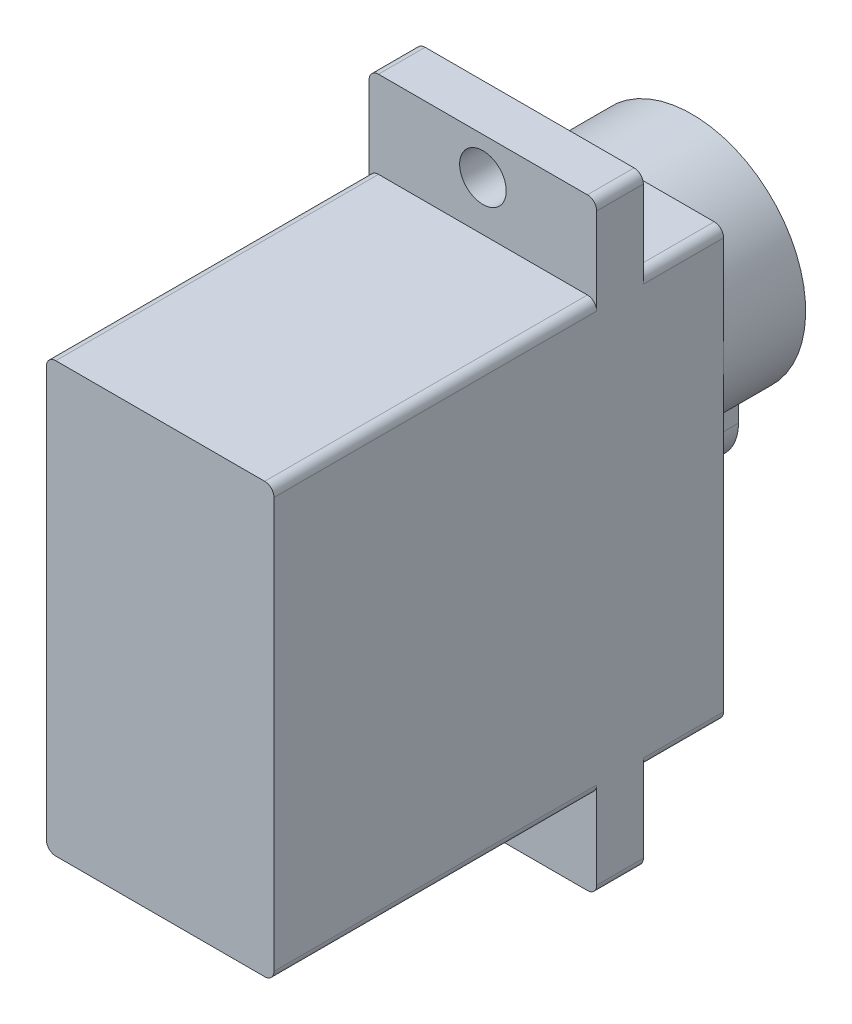
ISO-10303-21;
HEADER;
FILE_DESCRIPTION(('STEP AP214'),'2;1');
FILE_NAME('part.step','',(''),(''),'','','');
FILE_SCHEMA(('AUTOMOTIVE_DESIGN { 1 0 10303 214 1 1 1 1 }'));
ENDSEC;
DATA;
#1=APPLICATION_CONTEXT('core data for automotive mechanical design processes');
#2=APPLICATION_PROTOCOL_DEFINITION('international standard','automotive_design',2000,#1);
#3=PRODUCT_CONTEXT('',#1,'mechanical');
#4=PRODUCT('Part','Part','',(#3));
#5=PRODUCT_RELATED_PRODUCT_CATEGORY('part','',(#4));
#6=PRODUCT_DEFINITION_FORMATION('','',#4);
#7=PRODUCT_DEFINITION_CONTEXT('part definition',#1,'design');
#8=PRODUCT_DEFINITION('design','',#6,#7);
#9=PRODUCT_DEFINITION_SHAPE('','',#8);
#10=(LENGTH_UNIT() NAMED_UNIT(*) SI_UNIT(.MILLI.,.METRE.));
#11=(NAMED_UNIT(*) PLANE_ANGLE_UNIT() SI_UNIT($,.RADIAN.));
#12=(NAMED_UNIT(*) SI_UNIT($,.STERADIAN.) SOLID_ANGLE_UNIT());
#13=UNCERTAINTY_MEASURE_WITH_UNIT(LENGTH_MEASURE(1.E-05),#10,'distance_accuracy_value','');
#14=(GEOMETRIC_REPRESENTATION_CONTEXT(3) GLOBAL_UNCERTAINTY_ASSIGNED_CONTEXT((#13)) GLOBAL_UNIT_ASSIGNED_CONTEXT((#10,
#11,#12)) REPRESENTATION_CONTEXT('',''));
#15=CARTESIAN_POINT('',(0.,0.,0.));
#16=DIRECTION('',(0.,0.,1.));
#17=DIRECTION('',(1.,0.,0.));
#18=AXIS2_PLACEMENT_3D('',#15,#16,#17);
#19=CARTESIAN_POINT('',(5.6,-11.,-12.05));
#20=DIRECTION('',(0.,0.,1.));
#21=DIRECTION('',(1.,0.,0.));
#22=AXIS2_PLACEMENT_3D('',#19,#20,#21);
#23=PLANE('',#22);
#24=CARTESIAN_POINT('',(0.,5.4,-12.05));
#25=DIRECTION('',(0.,0.,-1.));
#26=DIRECTION('',(-1.,0.,0.));
#27=AXIS2_PLACEMENT_3D('',#24,#25,#26);
#28=CIRCLE('',#27,6.1);
#29=CARTESIAN_POINT('',(0.,11.5,-12.05));
#30=VERTEX_POINT('',#29);
#31=CARTESIAN_POINT('',(6.1,5.4,-12.05));
#32=VERTEX_POINT('',#31);
#33=EDGE_CURVE('E443',#30,#32,#28,.T.);
#34=ORIENTED_EDGE('',*,*,#33,.F.);
#35=DIRECTION('',(-1.,0.,0.));
#36=VECTOR('',#35,1.);
#37=CARTESIAN_POINT('',(-5.6,11.5,-12.05));
#38=LINE('',#37,#36);
#39=CARTESIAN_POINT('',(5.59999999999999,11.5,-12.05));
#40=VERTEX_POINT('',#39);
#41=EDGE_CURVE('E396',#40,#30,#38,.T.);
#42=ORIENTED_EDGE('',*,*,#41,.F.);
#43=CARTESIAN_POINT('',(5.6,11.,-12.05));
#44=DIRECTION('',(0.,0.,1.));
#45=DIRECTION('',(-1.,0.,0.));
#46=AXIS2_PLACEMENT_3D('',#43,#44,#45);
#47=CIRCLE('',#46,0.5);
#48=CARTESIAN_POINT('',(6.1,11.,-12.05));
#49=VERTEX_POINT('',#48);
#50=EDGE_CURVE('E392',#49,#40,#47,.T.);
#51=ORIENTED_EDGE('',*,*,#50,.F.);
#52=DIRECTION('',(0.,1.,0.));
#53=VECTOR('',#52,1.);
#54=CARTESIAN_POINT('',(6.1,-11.,-12.05));
#55=LINE('',#54,#53);
#56=EDGE_CURVE('E388',#32,#49,#55,.T.);
#57=ORIENTED_EDGE('',*,*,#56,.F.);
#58=EDGE_LOOP('',(#34,#42,#51,#57));
#59=FACE_BOUND('',#58,.T.);
#60=ADVANCED_FACE('F37',(#59),#23,.F.);
#61=CARTESIAN_POINT('',(2.5,-0.164171097297423,-12.05));
#62=VERTEX_POINT('',#61);
#63=EDGE_CURVE('E447',#32,#62,#28,.T.);
#64=ORIENTED_EDGE('',*,*,#63,.F.);
#65=CARTESIAN_POINT('',(6.1,-11.,-12.05));
#66=VERTEX_POINT('',#65);
#67=EDGE_CURVE('E389',#66,#32,#55,.T.);
#68=ORIENTED_EDGE('',*,*,#67,.F.);
#69=CARTESIAN_POINT('',(5.6,-11.,-12.05));
#70=DIRECTION('',(0.,0.,1.));
#71=DIRECTION('',(1.,0.,0.));
#72=AXIS2_PLACEMENT_3D('',#69,#70,#71);
#73=CIRCLE('',#72,0.5);
#74=CARTESIAN_POINT('',(5.59999999999999,-11.5,-12.05));
#75=VERTEX_POINT('',#74);
#76=EDGE_CURVE('E366',#75,#66,#73,.T.);
#77=ORIENTED_EDGE('',*,*,#76,.F.);
#78=DIRECTION('',(1.,0.,0.));
#79=VECTOR('',#78,1.);
#80=CARTESIAN_POINT('',(-5.6,-11.5,-12.05));
#81=LINE('',#80,#79);
#82=CARTESIAN_POINT('',(-5.6,-11.5,-12.05));
#83=VERTEX_POINT('',#82);
#84=EDGE_CURVE('E371',#83,#75,#81,.T.);
#85=ORIENTED_EDGE('',*,*,#84,.F.);
#86=CARTESIAN_POINT('',(-5.6,-11.,-12.05));
#87=DIRECTION('',(0.,0.,1.));
#88=DIRECTION('',(-1.,0.,0.));
#89=AXIS2_PLACEMENT_3D('',#86,#87,#88);
#90=CIRCLE('',#89,0.5);
#91=CARTESIAN_POINT('',(-6.1,-11.,-12.05));
#92=VERTEX_POINT('',#91);
#93=EDGE_CURVE('E406',#92,#83,#90,.T.);
#94=ORIENTED_EDGE('',*,*,#93,.F.);
#95=DIRECTION('',(0.,-1.,0.));
#96=VECTOR('',#95,1.);
#97=CARTESIAN_POINT('',(-6.1,-11.,-12.05));
#98=LINE('',#97,#96);
#99=CARTESIAN_POINT('',(-6.1,5.4,-12.05));
#100=VERTEX_POINT('',#99);
#101=EDGE_CURVE('E402',#100,#92,#98,.T.);
#102=ORIENTED_EDGE('',*,*,#101,.F.);
#103=CARTESIAN_POINT('',(-2.5,-0.164171097297423,-12.05));
#104=VERTEX_POINT('',#103);
#105=EDGE_CURVE('E449',#104,#100,#28,.T.);
#106=ORIENTED_EDGE('',*,*,#105,.F.);
#107=DIRECTION('',(0.,1.,0.));
#108=VECTOR('',#107,1.);
#109=CARTESIAN_POINT('',(-2.5,-1.6,-12.05));
#110=LINE('',#109,#108);
#111=CARTESIAN_POINT('',(-2.5,-1.6,-12.05));
#112=VERTEX_POINT('',#111);
#113=EDGE_CURVE('E455',#112,#104,#110,.T.);
#114=ORIENTED_EDGE('',*,*,#113,.F.);
#115=CARTESIAN_POINT('',(0.,-1.6,-12.05));
#116=DIRECTION('',(0.,0.,-1.));
#117=DIRECTION('',(-1.,0.,0.));
#118=AXIS2_PLACEMENT_3D('',#115,#116,#117);
#119=CIRCLE('',#118,2.5);
#120=CARTESIAN_POINT('',(2.5,-1.6,-12.05));
#121=VERTEX_POINT('',#120);
#122=EDGE_CURVE('E58',#121,#112,#119,.T.);
#123=ORIENTED_EDGE('',*,*,#122,.F.);
#124=DIRECTION('',(0.,-1.,0.));
#125=VECTOR('',#124,1.);
#126=CARTESIAN_POINT('',(2.5,-1.6,-12.05));
#127=LINE('',#126,#125);
#128=EDGE_CURVE('E53',#62,#121,#127,.T.);
#129=ORIENTED_EDGE('',*,*,#128,.F.);
#130=EDGE_LOOP('',(#64,#68,#77,#85,#94,#102,#106,#114,#123,#129));
#131=FACE_BOUND('',#130,.T.);
#132=ADVANCED_FACE('F464',(#131),#23,.F.);
#133=EDGE_CURVE('E441',#100,#30,#28,.T.);
#134=ORIENTED_EDGE('',*,*,#133,.F.);
#135=CARTESIAN_POINT('',(-6.1,11.,-12.05));
#136=VERTEX_POINT('',#135);
#137=EDGE_CURVE('E403',#136,#100,#98,.T.);
#138=ORIENTED_EDGE('',*,*,#137,.F.);
#139=CARTESIAN_POINT('',(-5.6,11.,-12.05));
#140=DIRECTION('',(0.,0.,1.));
#141=DIRECTION('',(-1.,0.,0.));
#142=AXIS2_PLACEMENT_3D('',#139,#140,#141);
#143=CIRCLE('',#142,0.5);
#144=CARTESIAN_POINT('',(-5.6,11.5,-12.05));
#145=VERTEX_POINT('',#144);
#146=EDGE_CURVE('E399',#145,#136,#143,.T.);
#147=ORIENTED_EDGE('',*,*,#146,.F.);
#148=EDGE_CURVE('E395',#30,#145,#38,.T.);
#149=ORIENTED_EDGE('',*,*,#148,.F.);
#150=EDGE_LOOP('',(#134,#138,#147,#149));
#151=FACE_BOUND('',#150,.T.);
#152=ADVANCED_FACE('F461',(#151),#23,.F.);
#153=CARTESIAN_POINT('',(5.6,-11.,12.05));
#154=DIRECTION('',(0.,0.,-1.));
#155=DIRECTION('',(-1.,0.,0.));
#156=AXIS2_PLACEMENT_3D('',#153,#154,#155);
#157=CYLINDRICAL_SURFACE('',#156,0.5);
#158=CARTESIAN_POINT('',(5.6,-11.,-5.25));
#159=DIRECTION('',(0.,0.,-1.));
#160=DIRECTION('',(-1.,0.,0.));
#161=AXIS2_PLACEMENT_3D('',#158,#159,#160);
#162=CIRCLE('',#161,0.5);
#163=CARTESIAN_POINT('',(6.1,-11.,-5.25));
#164=VERTEX_POINT('',#163);
#165=CARTESIAN_POINT('',(5.59999999999999,-11.5,-5.25));
#166=VERTEX_POINT('',#165);
#167=EDGE_CURVE('E278',#164,#166,#162,.T.);
#168=ORIENTED_EDGE('',*,*,#167,.F.);
#169=DIRECTION('',(0.,0.,-1.));
#170=VECTOR('',#169,1.);
#171=CARTESIAN_POINT('',(6.1,-11.,12.05));
#172=LINE('',#171,#170);
#173=CARTESIAN_POINT('',(6.1,-11.,12.05));
#174=VERTEX_POINT('',#173);
#175=EDGE_CURVE('E439',#174,#164,#172,.T.);
#176=ORIENTED_EDGE('',*,*,#175,.F.);
#177=CARTESIAN_POINT('',(5.6,-11.,12.05));
#178=DIRECTION('',(0.,0.,1.));
#179=DIRECTION('',(1.,0.,0.));
#180=AXIS2_PLACEMENT_3D('',#177,#178,#179);
#181=CIRCLE('',#180,0.5);
#182=CARTESIAN_POINT('',(5.59999999999999,-11.5,12.05));
#183=VERTEX_POINT('',#182);
#184=EDGE_CURVE('E367',#183,#174,#181,.T.);
#185=ORIENTED_EDGE('',*,*,#184,.F.);
#186=DIRECTION('',(0.,0.,-1.));
#187=VECTOR('',#186,1.);
#188=CARTESIAN_POINT('',(5.59999999999999,-11.5,12.05));
#189=LINE('',#188,#187);
#190=EDGE_CURVE('E411',#183,#166,#189,.T.);
#191=ORIENTED_EDGE('',*,*,#190,.T.);
#192=EDGE_LOOP('',(#168,#176,#185,#191));
#193=FACE_BOUND('',#192,.T.);
#194=ADVANCED_FACE('F575',(#193),#157,.T.);
#195=CARTESIAN_POINT('',(-5.6,-11.,12.05));
#196=DIRECTION('',(0.,0.,-1.));
#197=DIRECTION('',(-1.,0.,0.));
#198=AXIS2_PLACEMENT_3D('',#195,#196,#197);
#199=CYLINDRICAL_SURFACE('',#198,0.5);
#200=CARTESIAN_POINT('',(-5.6,-11.,-5.25));
#201=DIRECTION('',(0.,0.,-1.));
#202=DIRECTION('',(-1.,0.,0.));
#203=AXIS2_PLACEMENT_3D('',#200,#201,#202);
#204=CIRCLE('',#203,0.5);
#205=CARTESIAN_POINT('',(-5.6,-11.5,-5.25));
#206=VERTEX_POINT('',#205);
#207=CARTESIAN_POINT('',(-6.1,-11.,-5.25));
#208=VERTEX_POINT('',#207);
#209=EDGE_CURVE('E264',#206,#208,#204,.T.);
#210=ORIENTED_EDGE('',*,*,#209,.F.);
#211=DIRECTION('',(0.,0.,-1.));
#212=VECTOR('',#211,1.);
#213=CARTESIAN_POINT('',(-5.6,-11.5,12.05));
#214=LINE('',#213,#212);
#215=CARTESIAN_POINT('',(-5.6,-11.5,12.05));
#216=VERTEX_POINT('',#215);
#217=EDGE_CURVE('E415',#216,#206,#214,.T.);
#218=ORIENTED_EDGE('',*,*,#217,.F.);
#219=CARTESIAN_POINT('',(-5.6,-11.,12.05));
#220=DIRECTION('',(0.,0.,1.));
#221=DIRECTION('',(-1.,0.,0.));
#222=AXIS2_PLACEMENT_3D('',#219,#220,#221);
#223=CIRCLE('',#222,0.5);
#224=CARTESIAN_POINT('',(-6.1,-11.,12.05));
#225=VERTEX_POINT('',#224);
#226=EDGE_CURVE('E381',#225,#216,#223,.T.);
#227=ORIENTED_EDGE('',*,*,#226,.F.);
#228=DIRECTION('',(0.,0.,-1.));
#229=VECTOR('',#228,1.);
#230=CARTESIAN_POINT('',(-6.1,-11.,12.05));
#231=LINE('',#230,#229);
#232=EDGE_CURVE('E419',#225,#208,#231,.T.);
#233=ORIENTED_EDGE('',*,*,#232,.T.);
#234=EDGE_LOOP('',(#210,#218,#227,#233));
#235=FACE_BOUND('',#234,.T.);
#236=ADVANCED_FACE('F530',(#235),#199,.T.);
#237=CARTESIAN_POINT('',(-5.6,-11.5,12.05));
#238=DIRECTION('',(0.,1.,0.));
#239=DIRECTION('',(0.,0.,1.));
#240=AXIS2_PLACEMENT_3D('',#237,#238,#239);
#241=PLANE('',#240);
#242=DIRECTION('',(-1.,0.,0.));
#243=VECTOR('',#242,1.);
#244=CARTESIAN_POINT('',(5.59999999999999,-11.5,-5.25));
#245=LINE('',#244,#243);
#246=EDGE_CURVE('E280',#166,#206,#245,.T.);
#247=ORIENTED_EDGE('',*,*,#246,.F.);
#248=ORIENTED_EDGE('',*,*,#190,.F.);
#249=DIRECTION('',(1.,0.,0.));
#250=VECTOR('',#249,1.);
#251=CARTESIAN_POINT('',(-5.6,-11.5,12.05));
#252=LINE('',#251,#250);
#253=EDGE_CURVE('E383',#216,#183,#252,.T.);
#254=ORIENTED_EDGE('',*,*,#253,.F.);
#255=ORIENTED_EDGE('',*,*,#217,.T.);
#256=EDGE_LOOP('',(#247,#248,#254,#255));
#257=FACE_BOUND('',#256,.T.);
#258=ADVANCED_FACE('F578',(#257),#241,.F.);
#259=CARTESIAN_POINT('',(5.6,11.,12.05));
#260=DIRECTION('',(0.,0.,-1.));
#261=DIRECTION('',(-1.,0.,0.));
#262=AXIS2_PLACEMENT_3D('',#259,#260,#261);
#263=CYLINDRICAL_SURFACE('',#262,0.5);
#264=CARTESIAN_POINT('',(5.6,11.,-7.75));
#265=DIRECTION('',(0.,0.,-1.));
#266=DIRECTION('',(1.,0.,0.));
#267=AXIS2_PLACEMENT_3D('',#264,#265,#266);
#268=CIRCLE('',#267,0.5);
#269=CARTESIAN_POINT('',(5.59999999999999,11.5,-7.75));
#270=VERTEX_POINT('',#269);
#271=CARTESIAN_POINT('',(6.1,11.,-7.75));
#272=VERTEX_POINT('',#271);
#273=EDGE_CURVE('E315',#270,#272,#268,.T.);
#274=ORIENTED_EDGE('',*,*,#273,.T.);
#275=DIRECTION('',(0.,0.,-1.));
#276=VECTOR('',#275,1.);
#277=CARTESIAN_POINT('',(6.1,11.,12.05));
#278=LINE('',#277,#276);
#279=EDGE_CURVE('E434',#272,#49,#278,.T.);
#280=ORIENTED_EDGE('',*,*,#279,.T.);
#281=ORIENTED_EDGE('',*,*,#50,.T.);
#282=DIRECTION('',(0.,0.,-1.));
#283=VECTOR('',#282,1.);
#284=CARTESIAN_POINT('',(5.59999999999999,11.5,12.05));
#285=LINE('',#284,#283);
#286=EDGE_CURVE('E430',#270,#40,#285,.T.);
#287=ORIENTED_EDGE('',*,*,#286,.F.);
#288=EDGE_LOOP('',(#274,#280,#281,#287));
#289=FACE_BOUND('',#288,.T.);
#290=ADVANCED_FACE('F560',(#289),#263,.T.);
#291=CARTESIAN_POINT('',(-5.6,11.5,12.05));
#292=DIRECTION('',(0.,-1.,0.));
#293=DIRECTION('',(0.,0.,-1.));
#294=AXIS2_PLACEMENT_3D('',#291,#292,#293);
#295=PLANE('',#294);
#296=DIRECTION('',(1.,0.,0.));
#297=VECTOR('',#296,1.);
#298=CARTESIAN_POINT('',(5.59999999999999,11.5,-7.75));
#299=LINE('',#298,#297);
#300=CARTESIAN_POINT('',(-5.6,11.5,-7.75));
#301=VERTEX_POINT('',#300);
#302=EDGE_CURVE('E322',#301,#270,#299,.T.);
#303=ORIENTED_EDGE('',*,*,#302,.T.);
#304=ORIENTED_EDGE('',*,*,#286,.T.);
#305=ORIENTED_EDGE('',*,*,#41,.T.);
#306=ORIENTED_EDGE('',*,*,#148,.T.);
#307=DIRECTION('',(0.,0.,-1.));
#308=VECTOR('',#307,1.);
#309=CARTESIAN_POINT('',(-5.6,11.5,12.05));
#310=LINE('',#309,#308);
#311=EDGE_CURVE('E426',#301,#145,#310,.T.);
#312=ORIENTED_EDGE('',*,*,#311,.F.);
#313=EDGE_LOOP('',(#303,#304,#305,#306,#312));
#314=FACE_BOUND('',#313,.T.);
#315=ADVANCED_FACE('F477',(#314),#295,.F.);
#316=CARTESIAN_POINT('',(-5.6,11.,12.05));
#317=DIRECTION('',(0.,0.,-1.));
#318=DIRECTION('',(-1.,0.,0.));
#319=AXIS2_PLACEMENT_3D('',#316,#317,#318);
#320=CYLINDRICAL_SURFACE('',#319,0.5);
#321=CARTESIAN_POINT('',(-5.6,11.,-7.75));
#322=DIRECTION('',(0.,0.,-1.));
#323=DIRECTION('',(1.,0.,0.));
#324=AXIS2_PLACEMENT_3D('',#321,#322,#323);
#325=CIRCLE('',#324,0.5);
#326=CARTESIAN_POINT('',(-6.1,11.,-7.75));
#327=VERTEX_POINT('',#326);
#328=EDGE_CURVE('E350',#327,#301,#325,.T.);
#329=ORIENTED_EDGE('',*,*,#328,.T.);
#330=ORIENTED_EDGE('',*,*,#311,.T.);
#331=ORIENTED_EDGE('',*,*,#146,.T.);
#332=DIRECTION('',(0.,0.,-1.));
#333=VECTOR('',#332,1.);
#334=CARTESIAN_POINT('',(-6.1,11.,12.05));
#335=LINE('',#334,#333);
#336=EDGE_CURVE('E422',#327,#136,#335,.T.);
#337=ORIENTED_EDGE('',*,*,#336,.F.);
#338=EDGE_LOOP('',(#329,#330,#331,#337));
#339=FACE_BOUND('',#338,.T.);
#340=ADVANCED_FACE('F474',(#339),#320,.T.);
#341=CARTESIAN_POINT('',(6.1,-11.,-7.75));
#342=VERTEX_POINT('',#341);
#343=EDGE_CURVE('E438',#342,#66,#172,.T.);
#344=ORIENTED_EDGE('',*,*,#343,.F.);
#345=CARTESIAN_POINT('',(5.6,-11.,-7.75));
#346=DIRECTION('',(0.,0.,-1.));
#347=DIRECTION('',(-1.,0.,0.));
#348=AXIS2_PLACEMENT_3D('',#345,#346,#347);
#349=CIRCLE('',#348,0.5);
#350=CARTESIAN_POINT('',(5.59999999999999,-11.5,-7.75));
#351=VERTEX_POINT('',#350);
#352=EDGE_CURVE('E295',#342,#351,#349,.T.);
#353=ORIENTED_EDGE('',*,*,#352,.T.);
#354=EDGE_CURVE('E385',#351,#75,#189,.T.);
#355=ORIENTED_EDGE('',*,*,#354,.T.);
#356=ORIENTED_EDGE('',*,*,#76,.T.);
#357=EDGE_LOOP('',(#344,#353,#355,#356));
#358=FACE_BOUND('',#357,.T.);
#359=ADVANCED_FACE('F491',(#358),#157,.T.);
#360=CARTESIAN_POINT('',(6.1,-11.,12.05));
#361=DIRECTION('',(-1.,0.,0.));
#362=DIRECTION('',(0.,0.,1.));
#363=AXIS2_PLACEMENT_3D('',#360,#361,#362);
#364=PLANE('',#363);
#365=ORIENTED_EDGE('',*,*,#67,.T.);
#366=ORIENTED_EDGE('',*,*,#56,.T.);
#367=ORIENTED_EDGE('',*,*,#279,.F.);
#368=DIRECTION('',(0.,1.,0.));
#369=VECTOR('',#368,1.);
#370=CARTESIAN_POINT('',(6.1,11.,-7.75));
#371=LINE('',#370,#369);
#372=CARTESIAN_POINT('',(6.1,15.65,-7.75));
#373=VERTEX_POINT('',#372);
#374=EDGE_CURVE('E339',#272,#373,#371,.T.);
#375=ORIENTED_EDGE('',*,*,#374,.T.);
#376=DIRECTION('',(0.,0.,-1.));
#377=VECTOR('',#376,1.);
#378=CARTESIAN_POINT('',(6.1,15.65,-5.25));
#379=LINE('',#378,#377);
#380=CARTESIAN_POINT('',(6.1,15.65,-5.25));
#381=VERTEX_POINT('',#380);
#382=EDGE_CURVE('E363',#381,#373,#379,.T.);
#383=ORIENTED_EDGE('',*,*,#382,.F.);
#384=DIRECTION('',(0.,1.,0.));
#385=VECTOR('',#384,1.);
#386=CARTESIAN_POINT('',(6.1,11.,-5.25));
#387=LINE('',#386,#385);
#388=CARTESIAN_POINT('',(6.1,11.,-5.25));
#389=VERTEX_POINT('',#388);
#390=EDGE_CURVE('E321',#389,#381,#387,.T.);
#391=ORIENTED_EDGE('',*,*,#390,.F.);
#392=CARTESIAN_POINT('',(6.1,11.,12.05));
#393=VERTEX_POINT('',#392);
#394=EDGE_CURVE('E435',#393,#389,#278,.T.);
#395=ORIENTED_EDGE('',*,*,#394,.F.);
#396=DIRECTION('',(0.,1.,0.));
#397=VECTOR('',#396,1.);
#398=CARTESIAN_POINT('',(6.1,-11.,12.05));
#399=LINE('',#398,#397);
#400=EDGE_CURVE('E370',#174,#393,#399,.T.);
#401=ORIENTED_EDGE('',*,*,#400,.F.);
#402=ORIENTED_EDGE('',*,*,#175,.T.);
#403=DIRECTION('',(0.,1.,0.));
#404=VECTOR('',#403,1.);
#405=CARTESIAN_POINT('',(6.1,-11.,-5.25));
#406=LINE('',#405,#404);
#407=CARTESIAN_POINT('',(6.1,-15.65,-5.25));
#408=VERTEX_POINT('',#407);
#409=EDGE_CURVE('E276',#408,#164,#406,.T.);
#410=ORIENTED_EDGE('',*,*,#409,.F.);
#411=DIRECTION('',(0.,0.,-1.));
#412=VECTOR('',#411,1.);
#413=CARTESIAN_POINT('',(6.1,-15.65,-5.25));
#414=LINE('',#413,#412);
#415=CARTESIAN_POINT('',(6.1,-15.65,-7.75));
#416=VERTEX_POINT('',#415);
#417=EDGE_CURVE('E282',#408,#416,#414,.T.);
#418=ORIENTED_EDGE('',*,*,#417,.T.);
#419=DIRECTION('',(0.,1.,0.));
#420=VECTOR('',#419,1.);
#421=CARTESIAN_POINT('',(6.1,-11.,-7.75));
#422=LINE('',#421,#420);
#423=EDGE_CURVE('E293',#416,#342,#422,.T.);
#424=ORIENTED_EDGE('',*,*,#423,.T.);
#425=ORIENTED_EDGE('',*,*,#343,.T.);
#426=EDGE_LOOP('',(#365,#366,#367,#375,#383,#391,#395,#401,#402,#410,#418,#424,#425));
#427=FACE_BOUND('',#426,.T.);
#428=ADVANCED_FACE('F487',(#427),#364,.F.);
#429=ORIENTED_EDGE('',*,*,#394,.T.);
#430=CARTESIAN_POINT('',(5.6,11.,-5.25));
#431=DIRECTION('',(0.,0.,-1.));
#432=DIRECTION('',(1.,0.,0.));
#433=AXIS2_PLACEMENT_3D('',#430,#431,#432);
#434=CIRCLE('',#433,0.5);
#435=CARTESIAN_POINT('',(5.59999999999999,11.5,-5.25));
#436=VERTEX_POINT('',#435);
#437=EDGE_CURVE('E318',#436,#389,#434,.T.);
#438=ORIENTED_EDGE('',*,*,#437,.F.);
#439=CARTESIAN_POINT('',(5.59999999999999,11.5,12.05));
#440=VERTEX_POINT('',#439);
#441=EDGE_CURVE('E431',#440,#436,#285,.T.);
#442=ORIENTED_EDGE('',*,*,#441,.F.);
#443=CARTESIAN_POINT('',(5.6,11.,12.05));
#444=DIRECTION('',(0.,0.,1.));
#445=DIRECTION('',(-1.,0.,0.));
#446=AXIS2_PLACEMENT_3D('',#443,#444,#445);
#447=CIRCLE('',#446,0.5);
#448=EDGE_CURVE('E373',#393,#440,#447,.T.);
#449=ORIENTED_EDGE('',*,*,#448,.F.);
#450=EDGE_LOOP('',(#429,#438,#442,#449));
#451=FACE_BOUND('',#450,.T.);
#452=ADVANCED_FACE('F571',(#451),#263,.T.);
#453=ORIENTED_EDGE('',*,*,#441,.T.);
#454=DIRECTION('',(1.,0.,0.));
#455=VECTOR('',#454,1.);
#456=CARTESIAN_POINT('',(5.59999999999999,11.5,-5.25));
#457=LINE('',#456,#455);
#458=CARTESIAN_POINT('',(-5.6,11.5,-5.25));
#459=VERTEX_POINT('',#458);
#460=EDGE_CURVE('E334',#459,#436,#457,.T.);
#461=ORIENTED_EDGE('',*,*,#460,.F.);
#462=CARTESIAN_POINT('',(-5.6,11.5,12.05));
#463=VERTEX_POINT('',#462);
#464=EDGE_CURVE('E427',#463,#459,#310,.T.);
#465=ORIENTED_EDGE('',*,*,#464,.F.);
#466=DIRECTION('',(-1.,0.,0.));
#467=VECTOR('',#466,1.);
#468=CARTESIAN_POINT('',(-5.6,11.5,12.05));
#469=LINE('',#468,#467);
#470=EDGE_CURVE('E375',#440,#463,#469,.T.);
#471=ORIENTED_EDGE('',*,*,#470,.F.);
#472=EDGE_LOOP('',(#453,#461,#465,#471));
#473=FACE_BOUND('',#472,.T.);
#474=ADVANCED_FACE('F611',(#473),#295,.F.);
#475=ORIENTED_EDGE('',*,*,#464,.T.);
#476=CARTESIAN_POINT('',(-5.6,11.,-5.25));
#477=DIRECTION('',(0.,0.,-1.));
#478=DIRECTION('',(1.,0.,0.));
#479=AXIS2_PLACEMENT_3D('',#476,#477,#478);
#480=CIRCLE('',#479,0.5);
#481=CARTESIAN_POINT('',(-6.1,11.,-5.25));
#482=VERTEX_POINT('',#481);
#483=EDGE_CURVE('E332',#482,#459,#480,.T.);
#484=ORIENTED_EDGE('',*,*,#483,.F.);
#485=CARTESIAN_POINT('',(-6.1,11.,12.05));
#486=VERTEX_POINT('',#485);
#487=EDGE_CURVE('E423',#486,#482,#335,.T.);
#488=ORIENTED_EDGE('',*,*,#487,.F.);
#489=CARTESIAN_POINT('',(-5.6,11.,12.05));
#490=DIRECTION('',(0.,0.,1.));
#491=DIRECTION('',(-1.,0.,0.));
#492=AXIS2_PLACEMENT_3D('',#489,#490,#491);
#493=CIRCLE('',#492,0.5);
#494=EDGE_CURVE('E377',#463,#486,#493,.T.);
#495=ORIENTED_EDGE('',*,*,#494,.F.);
#496=EDGE_LOOP('',(#475,#484,#488,#495));
#497=FACE_BOUND('',#496,.T.);
#498=ADVANCED_FACE('F541',(#497),#320,.T.);
#499=CARTESIAN_POINT('',(-6.1,-11.,12.05));
#500=DIRECTION('',(1.,0.,0.));
#501=DIRECTION('',(0.,0.,-1.));
#502=AXIS2_PLACEMENT_3D('',#499,#500,#501);
#503=PLANE('',#502);
#504=ORIENTED_EDGE('',*,*,#137,.T.);
#505=ORIENTED_EDGE('',*,*,#101,.T.);
#506=CARTESIAN_POINT('',(-6.1,-11.,-7.75));
#507=VERTEX_POINT('',#506);
#508=EDGE_CURVE('E418',#507,#92,#231,.T.);
#509=ORIENTED_EDGE('',*,*,#508,.F.);
#510=DIRECTION('',(0.,-1.,0.));
#511=VECTOR('',#510,1.);
#512=CARTESIAN_POINT('',(-6.1,-11.,-7.75));
#513=LINE('',#512,#511);
#514=CARTESIAN_POINT('',(-6.1,-15.65,-7.75));
#515=VERTEX_POINT('',#514);
#516=EDGE_CURVE('E285',#507,#515,#513,.T.);
#517=ORIENTED_EDGE('',*,*,#516,.T.);
#518=DIRECTION('',(0.,0.,-1.));
#519=VECTOR('',#518,1.);
#520=CARTESIAN_POINT('',(-6.1,-15.65,-5.25));
#521=LINE('',#520,#519);
#522=CARTESIAN_POINT('',(-6.1,-15.65,-5.25));
#523=VERTEX_POINT('',#522);
#524=EDGE_CURVE('E308',#523,#515,#521,.T.);
#525=ORIENTED_EDGE('',*,*,#524,.F.);
#526=DIRECTION('',(0.,-1.,0.));
#527=VECTOR('',#526,1.);
#528=CARTESIAN_POINT('',(-6.1,-11.,-5.25));
#529=LINE('',#528,#527);
#530=EDGE_CURVE('E267',#208,#523,#529,.T.);
#531=ORIENTED_EDGE('',*,*,#530,.F.);
#532=ORIENTED_EDGE('',*,*,#232,.F.);
#533=DIRECTION('',(0.,-1.,0.));
#534=VECTOR('',#533,1.);
#535=CARTESIAN_POINT('',(-6.1,-11.,12.05));
#536=LINE('',#535,#534);
#537=EDGE_CURVE('E379',#486,#225,#536,.T.);
#538=ORIENTED_EDGE('',*,*,#537,.F.);
#539=ORIENTED_EDGE('',*,*,#487,.T.);
#540=DIRECTION('',(0.,-1.,0.));
#541=VECTOR('',#540,1.);
#542=CARTESIAN_POINT('',(-6.1,11.,-5.25));
#543=LINE('',#542,#541);
#544=CARTESIAN_POINT('',(-6.1,15.65,-5.25));
#545=VERTEX_POINT('',#544);
#546=EDGE_CURVE('E330',#545,#482,#543,.T.);
#547=ORIENTED_EDGE('',*,*,#546,.F.);
#548=DIRECTION('',(0.,0.,-1.));
#549=VECTOR('',#548,1.);
#550=CARTESIAN_POINT('',(-6.1,15.65,-5.25));
#551=LINE('',#550,#549);
#552=CARTESIAN_POINT('',(-6.1,15.65,-7.75));
#553=VERTEX_POINT('',#552);
#554=EDGE_CURVE('E336',#545,#553,#551,.T.);
#555=ORIENTED_EDGE('',*,*,#554,.T.);
#556=DIRECTION('',(0.,-1.,0.));
#557=VECTOR('',#556,1.);
#558=CARTESIAN_POINT('',(-6.1,11.,-7.75));
#559=LINE('',#558,#557);
#560=EDGE_CURVE('E347',#553,#327,#559,.T.);
#561=ORIENTED_EDGE('',*,*,#560,.T.);
#562=ORIENTED_EDGE('',*,*,#336,.T.);
#563=EDGE_LOOP('',(#504,#505,#509,#517,#525,#531,#532,#538,#539,#547,#555,#561,#562));
#564=FACE_BOUND('',#563,.T.);
#565=ADVANCED_FACE('F469',(#564),#503,.F.);
#566=CARTESIAN_POINT('',(-5.6,-11.5,-7.75));
#567=VERTEX_POINT('',#566);
#568=EDGE_CURVE('E414',#567,#83,#214,.T.);
#569=ORIENTED_EDGE('',*,*,#568,.F.);
#570=CARTESIAN_POINT('',(-5.6,-11.,-7.75));
#571=DIRECTION('',(0.,0.,-1.));
#572=DIRECTION('',(-1.,0.,0.));
#573=AXIS2_PLACEMENT_3D('',#570,#571,#572);
#574=CIRCLE('',#573,0.5);
#575=EDGE_CURVE('E262',#567,#507,#574,.T.);
#576=ORIENTED_EDGE('',*,*,#575,.T.);
#577=ORIENTED_EDGE('',*,*,#508,.T.);
#578=ORIENTED_EDGE('',*,*,#93,.T.);
#579=EDGE_LOOP('',(#569,#576,#577,#578));
#580=FACE_BOUND('',#579,.T.);
#581=ADVANCED_FACE('F498',(#580),#199,.T.);
#582=ORIENTED_EDGE('',*,*,#354,.F.);
#583=DIRECTION('',(-1.,0.,0.));
#584=VECTOR('',#583,1.);
#585=CARTESIAN_POINT('',(5.59999999999999,-11.5,-7.75));
#586=LINE('',#585,#584);
#587=EDGE_CURVE('E268',#351,#567,#586,.T.);
#588=ORIENTED_EDGE('',*,*,#587,.T.);
#589=ORIENTED_EDGE('',*,*,#568,.T.);
#590=ORIENTED_EDGE('',*,*,#84,.T.);
#591=EDGE_LOOP('',(#582,#588,#589,#590));
#592=FACE_BOUND('',#591,.T.);
#593=ADVANCED_FACE('F495',(#592),#241,.F.);
#594=CARTESIAN_POINT('',(5.6,-11.,12.05));
#595=DIRECTION('',(0.,0.,1.));
#596=DIRECTION('',(1.,0.,0.));
#597=AXIS2_PLACEMENT_3D('',#594,#595,#596);
#598=PLANE('',#597);
#599=ORIENTED_EDGE('',*,*,#184,.T.);
#600=ORIENTED_EDGE('',*,*,#400,.T.);
#601=ORIENTED_EDGE('',*,*,#448,.T.);
#602=ORIENTED_EDGE('',*,*,#470,.T.);
#603=ORIENTED_EDGE('',*,*,#494,.T.);
#604=ORIENTED_EDGE('',*,*,#537,.T.);
#605=ORIENTED_EDGE('',*,*,#226,.T.);
#606=ORIENTED_EDGE('',*,*,#253,.T.);
#607=EDGE_LOOP('',(#599,#600,#601,#602,#603,#604,#605,#606));
#608=FACE_BOUND('',#607,.T.);
#609=ADVANCED_FACE('F533',(#608),#598,.T.);
#610=CARTESIAN_POINT('',(5.6,11.,-5.25));
#611=DIRECTION('',(0.,0.,1.));
#612=DIRECTION('',(1.,0.,0.));
#613=AXIS2_PLACEMENT_3D('',#610,#611,#612);
#614=PLANE('',#613);
#615=ORIENTED_EDGE('',*,*,#437,.T.);
#616=ORIENTED_EDGE('',*,*,#390,.T.);
#617=CARTESIAN_POINT('',(5.6,15.65,-5.25));
#618=DIRECTION('',(0.,0.,1.));
#619=DIRECTION('',(1.,0.,0.));
#620=AXIS2_PLACEMENT_3D('',#617,#618,#619);
#621=CIRCLE('',#620,0.5);
#622=CARTESIAN_POINT('',(5.59999999999999,16.15,-5.25));
#623=VERTEX_POINT('',#622);
#624=EDGE_CURVE('E324',#381,#623,#621,.T.);
#625=ORIENTED_EDGE('',*,*,#624,.T.);
#626=DIRECTION('',(-1.,0.,0.));
#627=VECTOR('',#626,1.);
#628=CARTESIAN_POINT('',(-5.6,16.15,-5.25));
#629=LINE('',#628,#627);
#630=CARTESIAN_POINT('',(-5.6,16.15,-5.25));
#631=VERTEX_POINT('',#630);
#632=EDGE_CURVE('E326',#623,#631,#629,.T.);
#633=ORIENTED_EDGE('',*,*,#632,.T.);
#634=CARTESIAN_POINT('',(-5.6,15.65,-5.25));
#635=DIRECTION('',(0.,0.,1.));
#636=DIRECTION('',(-1.,0.,0.));
#637=AXIS2_PLACEMENT_3D('',#634,#635,#636);
#638=CIRCLE('',#637,0.5);
#639=EDGE_CURVE('E328',#631,#545,#638,.T.);
#640=ORIENTED_EDGE('',*,*,#639,.T.);
#641=ORIENTED_EDGE('',*,*,#546,.T.);
#642=ORIENTED_EDGE('',*,*,#483,.T.);
#643=ORIENTED_EDGE('',*,*,#460,.T.);
#644=EDGE_LOOP('',(#615,#616,#625,#633,#640,#641,#642,#643));
#645=FACE_BOUND('',#644,.T.);
#646=CARTESIAN_POINT('',(0.,14.15,-5.25));
#647=DIRECTION('',(0.,0.,1.));
#648=DIRECTION('',(1.,0.,0.));
#649=AXIS2_PLACEMENT_3D('',#646,#647,#648);
#650=CIRCLE('',#649,1.25);
#651=CARTESIAN_POINT('',(1.25,14.15,-5.25));
#652=VERTEX_POINT('',#651);
#653=EDGE_CURVE('E312',#652,#652,#650,.T.);
#654=ORIENTED_EDGE('',*,*,#653,.F.);
#655=EDGE_LOOP('',(#654));
#656=FACE_BOUND('',#655,.T.);
#657=ADVANCED_FACE('F545',(#645,#656),#614,.T.);
#658=CARTESIAN_POINT('',(5.6,11.,-7.75));
#659=DIRECTION('',(0.,0.,1.));
#660=DIRECTION('',(1.,0.,0.));
#661=AXIS2_PLACEMENT_3D('',#658,#659,#660);
#662=PLANE('',#661);
#663=ORIENTED_EDGE('',*,*,#273,.F.);
#664=ORIENTED_EDGE('',*,*,#302,.F.);
#665=ORIENTED_EDGE('',*,*,#328,.F.);
#666=ORIENTED_EDGE('',*,*,#560,.F.);
#667=CARTESIAN_POINT('',(-5.6,15.65,-7.75));
#668=DIRECTION('',(0.,0.,1.));
#669=DIRECTION('',(-1.,0.,0.));
#670=AXIS2_PLACEMENT_3D('',#667,#668,#669);
#671=CIRCLE('',#670,0.5);
#672=CARTESIAN_POINT('',(-5.6,16.15,-7.75));
#673=VERTEX_POINT('',#672);
#674=EDGE_CURVE('E345',#673,#553,#671,.T.);
#675=ORIENTED_EDGE('',*,*,#674,.F.);
#676=DIRECTION('',(-1.,0.,0.));
#677=VECTOR('',#676,1.);
#678=CARTESIAN_POINT('',(-5.6,16.15,-7.75));
#679=LINE('',#678,#677);
#680=CARTESIAN_POINT('',(5.59999999999999,16.15,-7.75));
#681=VERTEX_POINT('',#680);
#682=EDGE_CURVE('E343',#681,#673,#679,.T.);
#683=ORIENTED_EDGE('',*,*,#682,.F.);
#684=CARTESIAN_POINT('',(5.6,15.65,-7.75));
#685=DIRECTION('',(0.,0.,1.));
#686=DIRECTION('',(1.,0.,0.));
#687=AXIS2_PLACEMENT_3D('',#684,#685,#686);
#688=CIRCLE('',#687,0.5);
#689=EDGE_CURVE('E341',#373,#681,#688,.T.);
#690=ORIENTED_EDGE('',*,*,#689,.F.);
#691=ORIENTED_EDGE('',*,*,#374,.F.);
#692=EDGE_LOOP('',(#663,#664,#665,#666,#675,#683,#690,#691));
#693=FACE_BOUND('',#692,.T.);
#694=CARTESIAN_POINT('',(0.,14.15,-7.75));
#695=DIRECTION('',(0.,0.,1.));
#696=DIRECTION('',(1.,0.,0.));
#697=AXIS2_PLACEMENT_3D('',#694,#695,#696);
#698=CIRCLE('',#697,1.25);
#699=CARTESIAN_POINT('',(1.25,14.15,-7.75));
#700=VERTEX_POINT('',#699);
#701=EDGE_CURVE('E311',#700,#700,#698,.T.);
#702=ORIENTED_EDGE('',*,*,#701,.T.);
#703=EDGE_LOOP('',(#702));
#704=FACE_BOUND('',#703,.T.);
#705=ADVANCED_FACE('F556',(#693,#704),#662,.F.);
#706=CARTESIAN_POINT('',(5.6,15.65,-5.25));
#707=DIRECTION('',(0.,0.,-1.));
#708=DIRECTION('',(-1.,0.,0.));
#709=AXIS2_PLACEMENT_3D('',#706,#707,#708);
#710=CYLINDRICAL_SURFACE('',#709,0.5);
#711=ORIENTED_EDGE('',*,*,#689,.T.);
#712=DIRECTION('',(0.,0.,-1.));
#713=VECTOR('',#712,1.);
#714=CARTESIAN_POINT('',(5.59999999999999,16.15,-5.25));
#715=LINE('',#714,#713);
#716=EDGE_CURVE('E360',#623,#681,#715,.T.);
#717=ORIENTED_EDGE('',*,*,#716,.F.);
#718=ORIENTED_EDGE('',*,*,#624,.F.);
#719=ORIENTED_EDGE('',*,*,#382,.T.);
#720=EDGE_LOOP('',(#711,#717,#718,#719));
#721=FACE_BOUND('',#720,.T.);
#722=ADVANCED_FACE('F564',(#721),#710,.T.);
#723=CARTESIAN_POINT('',(-5.6,16.15,-5.25));
#724=DIRECTION('',(0.,-1.,0.));
#725=DIRECTION('',(0.,0.,-1.));
#726=AXIS2_PLACEMENT_3D('',#723,#724,#725);
#727=PLANE('',#726);
#728=ORIENTED_EDGE('',*,*,#682,.T.);
#729=DIRECTION('',(0.,0.,-1.));
#730=VECTOR('',#729,1.);
#731=CARTESIAN_POINT('',(-5.6,16.15,-5.25));
#732=LINE('',#731,#730);
#733=EDGE_CURVE('E357',#631,#673,#732,.T.);
#734=ORIENTED_EDGE('',*,*,#733,.F.);
#735=ORIENTED_EDGE('',*,*,#632,.F.);
#736=ORIENTED_EDGE('',*,*,#716,.T.);
#737=EDGE_LOOP('',(#728,#734,#735,#736));
#738=FACE_BOUND('',#737,.T.);
#739=ADVANCED_FACE('F761',(#738),#727,.F.);
#740=CARTESIAN_POINT('',(-5.6,15.65,-5.25));
#741=DIRECTION('',(0.,0.,-1.));
#742=DIRECTION('',(-1.,0.,0.));
#743=AXIS2_PLACEMENT_3D('',#740,#741,#742);
#744=CYLINDRICAL_SURFACE('',#743,0.5);
#745=ORIENTED_EDGE('',*,*,#674,.T.);
#746=ORIENTED_EDGE('',*,*,#554,.F.);
#747=ORIENTED_EDGE('',*,*,#639,.F.);
#748=ORIENTED_EDGE('',*,*,#733,.T.);
#749=EDGE_LOOP('',(#745,#746,#747,#748));
#750=FACE_BOUND('',#749,.T.);
#751=ADVANCED_FACE('F552',(#750),#744,.T.);
#752=CARTESIAN_POINT('',(0.,14.15,-5.25));
#753=DIRECTION('',(0.,0.,-1.));
#754=DIRECTION('',(-1.,0.,0.));
#755=AXIS2_PLACEMENT_3D('',#752,#753,#754);
#756=CYLINDRICAL_SURFACE('',#755,1.25);
#757=ORIENTED_EDGE('',*,*,#653,.T.);
#758=EDGE_LOOP('',(#757));
#759=FACE_BOUND('',#758,.T.);
#760=ORIENTED_EDGE('',*,*,#701,.F.);
#761=EDGE_LOOP('',(#760));
#762=FACE_BOUND('',#761,.T.);
#763=ADVANCED_FACE('F743',(#759,#762),#756,.F.);
#764=CARTESIAN_POINT('',(-5.6,-11.,-5.25));
#765=DIRECTION('',(0.,0.,-1.));
#766=DIRECTION('',(-1.,0.,0.));
#767=AXIS2_PLACEMENT_3D('',#764,#765,#766);
#768=PLANE('',#767);
#769=ORIENTED_EDGE('',*,*,#209,.T.);
#770=ORIENTED_EDGE('',*,*,#530,.T.);
#771=CARTESIAN_POINT('',(-5.6,-15.65,-5.25));
#772=DIRECTION('',(0.,0.,1.));
#773=DIRECTION('',(-1.,0.,0.));
#774=AXIS2_PLACEMENT_3D('',#771,#772,#773);
#775=CIRCLE('',#774,0.5);
#776=CARTESIAN_POINT('',(-5.59999999999999,-16.15,-5.25));
#777=VERTEX_POINT('',#776);
#778=EDGE_CURVE('E270',#523,#777,#775,.T.);
#779=ORIENTED_EDGE('',*,*,#778,.T.);
#780=DIRECTION('',(1.,0.,0.));
#781=VECTOR('',#780,1.);
#782=CARTESIAN_POINT('',(-5.59999999999999,-16.15,-5.25));
#783=LINE('',#782,#781);
#784=CARTESIAN_POINT('',(5.6,-16.15,-5.25));
#785=VERTEX_POINT('',#784);
#786=EDGE_CURVE('E272',#777,#785,#783,.T.);
#787=ORIENTED_EDGE('',*,*,#786,.T.);
#788=CARTESIAN_POINT('',(5.6,-15.65,-5.25));
#789=DIRECTION('',(0.,0.,1.));
#790=DIRECTION('',(-1.,0.,0.));
#791=AXIS2_PLACEMENT_3D('',#788,#789,#790);
#792=CIRCLE('',#791,0.5);
#793=EDGE_CURVE('E274',#785,#408,#792,.T.);
#794=ORIENTED_EDGE('',*,*,#793,.T.);
#795=ORIENTED_EDGE('',*,*,#409,.T.);
#796=ORIENTED_EDGE('',*,*,#167,.T.);
#797=ORIENTED_EDGE('',*,*,#246,.T.);
#798=EDGE_LOOP('',(#769,#770,#779,#787,#794,#795,#796,#797));
#799=FACE_BOUND('',#798,.T.);
#800=CARTESIAN_POINT('',(0.,-14.15,-5.25));
#801=DIRECTION('',(0.,0.,1.));
#802=DIRECTION('',(-1.,0.,0.));
#803=AXIS2_PLACEMENT_3D('',#800,#801,#802);
#804=CIRCLE('',#803,1.25);
#805=CARTESIAN_POINT('',(-1.25,-14.15,-5.25));
#806=VERTEX_POINT('',#805);
#807=EDGE_CURVE('E255',#806,#806,#804,.T.);
#808=ORIENTED_EDGE('',*,*,#807,.F.);
#809=EDGE_LOOP('',(#808));
#810=FACE_BOUND('',#809,.T.);
#811=ADVANCED_FACE('F521',(#799,#810),#768,.F.);
#812=CARTESIAN_POINT('',(-5.6,-11.,-7.75));
#813=DIRECTION('',(0.,0.,-1.));
#814=DIRECTION('',(-1.,0.,0.));
#815=AXIS2_PLACEMENT_3D('',#812,#813,#814);
#816=PLANE('',#815);
#817=ORIENTED_EDGE('',*,*,#575,.F.);
#818=ORIENTED_EDGE('',*,*,#587,.F.);
#819=ORIENTED_EDGE('',*,*,#352,.F.);
#820=ORIENTED_EDGE('',*,*,#423,.F.);
#821=CARTESIAN_POINT('',(5.6,-15.65,-7.75));
#822=DIRECTION('',(0.,0.,1.));
#823=DIRECTION('',(-1.,0.,0.));
#824=AXIS2_PLACEMENT_3D('',#821,#822,#823);
#825=CIRCLE('',#824,0.5);
#826=CARTESIAN_POINT('',(5.6,-16.15,-7.75));
#827=VERTEX_POINT('',#826);
#828=EDGE_CURVE('E291',#827,#416,#825,.T.);
#829=ORIENTED_EDGE('',*,*,#828,.F.);
#830=DIRECTION('',(1.,0.,0.));
#831=VECTOR('',#830,1.);
#832=CARTESIAN_POINT('',(-5.59999999999999,-16.15,-7.75));
#833=LINE('',#832,#831);
#834=CARTESIAN_POINT('',(-5.59999999999999,-16.15,-7.75));
#835=VERTEX_POINT('',#834);
#836=EDGE_CURVE('E289',#835,#827,#833,.T.);
#837=ORIENTED_EDGE('',*,*,#836,.F.);
#838=CARTESIAN_POINT('',(-5.6,-15.65,-7.75));
#839=DIRECTION('',(0.,0.,1.));
#840=DIRECTION('',(-1.,0.,0.));
#841=AXIS2_PLACEMENT_3D('',#838,#839,#840);
#842=CIRCLE('',#841,0.5);
#843=EDGE_CURVE('E287',#515,#835,#842,.T.);
#844=ORIENTED_EDGE('',*,*,#843,.F.);
#845=ORIENTED_EDGE('',*,*,#516,.F.);
#846=EDGE_LOOP('',(#817,#818,#819,#820,#829,#837,#844,#845));
#847=FACE_BOUND('',#846,.T.);
#848=CARTESIAN_POINT('',(0.,-14.15,-7.75));
#849=DIRECTION('',(0.,0.,1.));
#850=DIRECTION('',(-1.,0.,0.));
#851=AXIS2_PLACEMENT_3D('',#848,#849,#850);
#852=CIRCLE('',#851,1.25);
#853=CARTESIAN_POINT('',(-1.25,-14.15,-7.75));
#854=VERTEX_POINT('',#853);
#855=EDGE_CURVE('E252',#854,#854,#852,.T.);
#856=ORIENTED_EDGE('',*,*,#855,.T.);
#857=EDGE_LOOP('',(#856));
#858=FACE_BOUND('',#857,.T.);
#859=ADVANCED_FACE('F507',(#847,#858),#816,.T.);
#860=CARTESIAN_POINT('',(-5.6,-15.65,-5.25));
#861=DIRECTION('',(0.,0.,-1.));
#862=DIRECTION('',(-1.,0.,0.));
#863=AXIS2_PLACEMENT_3D('',#860,#861,#862);
#864=CYLINDRICAL_SURFACE('',#863,0.5);
#865=ORIENTED_EDGE('',*,*,#843,.T.);
#866=DIRECTION('',(0.,0.,-1.));
#867=VECTOR('',#866,1.);
#868=CARTESIAN_POINT('',(-5.59999999999999,-16.15,-5.25));
#869=LINE('',#868,#867);
#870=EDGE_CURVE('E305',#777,#835,#869,.T.);
#871=ORIENTED_EDGE('',*,*,#870,.F.);
#872=ORIENTED_EDGE('',*,*,#778,.F.);
#873=ORIENTED_EDGE('',*,*,#524,.T.);
#874=EDGE_LOOP('',(#865,#871,#872,#873));
#875=FACE_BOUND('',#874,.T.);
#876=ADVANCED_FACE('F504',(#875),#864,.T.);
#877=CARTESIAN_POINT('',(-5.59999999999999,-16.15,-5.25));
#878=DIRECTION('',(0.,1.,0.));
#879=DIRECTION('',(-1.,0.,0.));
#880=AXIS2_PLACEMENT_3D('',#877,#878,#879);
#881=PLANE('',#880);
#882=ORIENTED_EDGE('',*,*,#836,.T.);
#883=DIRECTION('',(0.,0.,-1.));
#884=VECTOR('',#883,1.);
#885=CARTESIAN_POINT('',(5.6,-16.15,-5.25));
#886=LINE('',#885,#884);
#887=EDGE_CURVE('E302',#785,#827,#886,.T.);
#888=ORIENTED_EDGE('',*,*,#887,.F.);
#889=ORIENTED_EDGE('',*,*,#786,.F.);
#890=ORIENTED_EDGE('',*,*,#870,.T.);
#891=EDGE_LOOP('',(#882,#888,#889,#890));
#892=FACE_BOUND('',#891,.T.);
#893=ADVANCED_FACE('F513',(#892),#881,.F.);
#894=CARTESIAN_POINT('',(5.6,-15.65,-5.25));
#895=DIRECTION('',(0.,0.,-1.));
#896=DIRECTION('',(-1.,0.,0.));
#897=AXIS2_PLACEMENT_3D('',#894,#895,#896);
#898=CYLINDRICAL_SURFACE('',#897,0.5);
#899=ORIENTED_EDGE('',*,*,#828,.T.);
#900=ORIENTED_EDGE('',*,*,#417,.F.);
#901=ORIENTED_EDGE('',*,*,#793,.F.);
#902=ORIENTED_EDGE('',*,*,#887,.T.);
#903=EDGE_LOOP('',(#899,#900,#901,#902));
#904=FACE_BOUND('',#903,.T.);
#905=ADVANCED_FACE('F517',(#904),#898,.T.);
#906=CARTESIAN_POINT('',(0.,-14.15,-5.25));
#907=DIRECTION('',(0.,0.,-1.));
#908=DIRECTION('',(-1.,0.,0.));
#909=AXIS2_PLACEMENT_3D('',#906,#907,#908);
#910=CYLINDRICAL_SURFACE('',#909,1.25);
#911=ORIENTED_EDGE('',*,*,#807,.T.);
#912=EDGE_LOOP('',(#911));
#913=FACE_BOUND('',#912,.T.);
#914=ORIENTED_EDGE('',*,*,#855,.F.);
#915=EDGE_LOOP('',(#914));
#916=FACE_BOUND('',#915,.T.);
#917=ADVANCED_FACE('F650',(#913,#916),#910,.F.);
#918=CARTESIAN_POINT('',(0.,-1.6,-16.45));
#919=DIRECTION('',(0.,0.,1.));
#920=DIRECTION('',(1.,0.,0.));
#921=AXIS2_PLACEMENT_3D('',#918,#919,#920);
#922=CYLINDRICAL_SURFACE('',#921,2.5);
#923=ORIENTED_EDGE('',*,*,#122,.T.);
#924=DIRECTION('',(0.,0.,1.));
#925=VECTOR('',#924,1.);
#926=CARTESIAN_POINT('',(-2.5,-1.6,-16.45));
#927=LINE('',#926,#925);
#928=CARTESIAN_POINT('',(-2.5,-1.6,-16.45));
#929=VERTEX_POINT('',#928);
#930=EDGE_CURVE('E235',#929,#112,#927,.T.);
#931=ORIENTED_EDGE('',*,*,#930,.F.);
#932=CARTESIAN_POINT('',(0.,-1.6,-16.45));
#933=DIRECTION('',(0.,0.,-1.));
#934=DIRECTION('',(-1.,0.,0.));
#935=AXIS2_PLACEMENT_3D('',#932,#933,#934);
#936=CIRCLE('',#935,2.5);
#937=CARTESIAN_POINT('',(2.5,-1.6,-16.45));
#938=VERTEX_POINT('',#937);
#939=EDGE_CURVE('E241',#938,#929,#936,.T.);
#940=ORIENTED_EDGE('',*,*,#939,.F.);
#941=DIRECTION('',(0.,0.,1.));
#942=VECTOR('',#941,1.);
#943=CARTESIAN_POINT('',(2.5,-1.6,-16.45));
#944=LINE('',#943,#942);
#945=EDGE_CURVE('E734',#938,#121,#944,.T.);
#946=ORIENTED_EDGE('',*,*,#945,.T.);
#947=EDGE_LOOP('',(#923,#931,#940,#946));
#948=FACE_BOUND('',#947,.T.);
#949=ADVANCED_FACE('F251',(#948),#922,.T.);
#950=CARTESIAN_POINT('',(-2.5,-1.6,-16.45));
#951=DIRECTION('',(1.,0.,0.));
#952=DIRECTION('',(0.,0.,-1.));
#953=AXIS2_PLACEMENT_3D('',#950,#951,#952);
#954=PLANE('',#953);
#955=ORIENTED_EDGE('',*,*,#113,.T.);
#956=DIRECTION('',(0.,0.,1.));
#957=VECTOR('',#956,1.);
#958=CARTESIAN_POINT('',(-2.5,-0.164171097297423,-16.45));
#959=LINE('',#958,#957);
#960=CARTESIAN_POINT('',(-2.5,-0.164171097297423,-16.45));
#961=VERTEX_POINT('',#960);
#962=EDGE_CURVE('E237',#961,#104,#959,.T.);
#963=ORIENTED_EDGE('',*,*,#962,.F.);
#964=DIRECTION('',(0.,1.,0.));
#965=VECTOR('',#964,1.);
#966=CARTESIAN_POINT('',(-2.5,-1.6,-16.45));
#967=LINE('',#966,#965);
#968=EDGE_CURVE('E230',#929,#961,#967,.T.);
#969=ORIENTED_EDGE('',*,*,#968,.F.);
#970=ORIENTED_EDGE('',*,*,#930,.T.);
#971=EDGE_LOOP('',(#955,#963,#969,#970));
#972=FACE_BOUND('',#971,.T.);
#973=ADVANCED_FACE('F233',(#972),#954,.F.);
#974=CARTESIAN_POINT('',(0.,5.4,-16.45));
#975=DIRECTION('',(0.,0.,1.));
#976=DIRECTION('',(1.,0.,0.));
#977=AXIS2_PLACEMENT_3D('',#974,#975,#976);
#978=CYLINDRICAL_SURFACE('',#977,6.1);
#979=ORIENTED_EDGE('',*,*,#105,.T.);
#980=ORIENTED_EDGE('',*,*,#133,.T.);
#981=ORIENTED_EDGE('',*,*,#33,.T.);
#982=ORIENTED_EDGE('',*,*,#63,.T.);
#983=DIRECTION('',(0.,0.,1.));
#984=VECTOR('',#983,1.);
#985=CARTESIAN_POINT('',(2.5,-0.164171097297423,-16.45));
#986=LINE('',#985,#984);
#987=CARTESIAN_POINT('',(2.5,-0.164171097297423,-16.45));
#988=VERTEX_POINT('',#987);
#989=EDGE_CURVE('E257',#988,#62,#986,.T.);
#990=ORIENTED_EDGE('',*,*,#989,.F.);
#991=CARTESIAN_POINT('',(0.,5.4,-16.45));
#992=DIRECTION('',(0.,0.,-1.));
#993=DIRECTION('',(-1.,0.,0.));
#994=AXIS2_PLACEMENT_3D('',#991,#992,#993);
#995=CIRCLE('',#994,6.1);
#996=EDGE_CURVE('E240',#961,#988,#995,.T.);
#997=ORIENTED_EDGE('',*,*,#996,.F.);
#998=ORIENTED_EDGE('',*,*,#962,.T.);
#999=EDGE_LOOP('',(#979,#980,#981,#982,#990,#997,#998));
#1000=FACE_BOUND('',#999,.T.);
#1001=ADVANCED_FACE('F456',(#1000),#978,.T.);
#1002=CARTESIAN_POINT('',(2.5,-1.6,-16.45));
#1003=DIRECTION('',(-1.,0.,0.));
#1004=DIRECTION('',(0.,0.,1.));
#1005=AXIS2_PLACEMENT_3D('',#1002,#1003,#1004);
#1006=PLANE('',#1005);
#1007=ORIENTED_EDGE('',*,*,#128,.T.);
#1008=ORIENTED_EDGE('',*,*,#945,.F.);
#1009=DIRECTION('',(0.,-1.,0.));
#1010=VECTOR('',#1009,1.);
#1011=CARTESIAN_POINT('',(2.5,-1.6,-16.45));
#1012=LINE('',#1011,#1010);
#1013=EDGE_CURVE('E246',#988,#938,#1012,.T.);
#1014=ORIENTED_EDGE('',*,*,#1013,.F.);
#1015=ORIENTED_EDGE('',*,*,#989,.T.);
#1016=EDGE_LOOP('',(#1007,#1008,#1014,#1015));
#1017=FACE_BOUND('',#1016,.T.);
#1018=ADVANCED_FACE('F669',(#1017),#1006,.F.);
#1019=CARTESIAN_POINT('',(0.,-1.6,-16.45));
#1020=DIRECTION('',(0.,0.,-1.));
#1021=DIRECTION('',(-1.,0.,0.));
#1022=AXIS2_PLACEMENT_3D('',#1019,#1020,#1021);
#1023=PLANE('',#1022);
#1024=CARTESIAN_POINT('',(0.,5.4,-16.45));
#1025=DIRECTION('',(0.,0.,-1.));
#1026=DIRECTION('',(-1.,0.,0.));
#1027=AXIS2_PLACEMENT_3D('',#1024,#1025,#1026);
#1028=CIRCLE('',#1027,0.5);
#1029=CARTESIAN_POINT('',(-0.5,5.4,-16.45));
#1030=VERTEX_POINT('',#1029);
#1031=EDGE_CURVE('E729',#1030,#1030,#1028,.T.);
#1032=ORIENTED_EDGE('',*,*,#1031,.F.);
#1033=EDGE_LOOP('',(#1032));
#1034=FACE_BOUND('',#1033,.T.);
#1035=ORIENTED_EDGE('',*,*,#939,.T.);
#1036=ORIENTED_EDGE('',*,*,#968,.T.);
#1037=ORIENTED_EDGE('',*,*,#996,.T.);
#1038=ORIENTED_EDGE('',*,*,#1013,.T.);
#1039=EDGE_LOOP('',(#1035,#1036,#1037,#1038));
#1040=FACE_BOUND('',#1039,.T.);
#1041=ADVANCED_FACE('F244',(#1034,#1040),#1023,.T.);
#1042=CARTESIAN_POINT('',(0.,5.4,-20.15));
#1043=DIRECTION('',(0.,0.,1.));
#1044=DIRECTION('',(1.,0.,0.));
#1045=AXIS2_PLACEMENT_3D('',#1042,#1043,#1044);
#1046=CYLINDRICAL_SURFACE('',#1045,0.5);
#1047=CARTESIAN_POINT('',(0.,5.4,-20.05));
#1048=DIRECTION('',(0.,0.,-1.));
#1049=DIRECTION('',(-1.,0.,0.));
#1050=AXIS2_PLACEMENT_3D('',#1047,#1048,#1049);
#1051=CIRCLE('',#1050,0.5);
#1052=CARTESIAN_POINT('',(-0.5,5.4,-20.05));
#1053=VERTEX_POINT('',#1052);
#1054=EDGE_CURVE('E11',#1053,#1053,#1051,.F.);
#1055=ORIENTED_EDGE('',*,*,#1054,.T.);
#1056=EDGE_LOOP('',(#1055));
#1057=FACE_BOUND('',#1056,.T.);
#1058=ORIENTED_EDGE('',*,*,#1031,.T.);
#1059=EDGE_LOOP('',(#1058));
#1060=FACE_BOUND('',#1059,.T.);
#1061=ADVANCED_FACE('F687',(#1057,#1060),#1046,.T.);
#1062=CARTESIAN_POINT('',(0.,5.4,-20.15));
#1063=DIRECTION('',(0.,0.,-1.));
#1064=DIRECTION('',(-1.,0.,0.));
#1065=AXIS2_PLACEMENT_3D('',#1062,#1063,#1064);
#1066=PLANE('',#1065);
#1067=CARTESIAN_POINT('',(0.,5.4,-20.15));
#1068=DIRECTION('',(0.,0.,-1.));
#1069=DIRECTION('',(-1.,0.,0.));
#1070=AXIS2_PLACEMENT_3D('',#1067,#1068,#1069);
#1071=CIRCLE('',#1070,0.399999999999998);
#1072=CARTESIAN_POINT('',(-0.399999999999998,5.4,-20.15));
#1073=VERTEX_POINT('',#1072);
#1074=EDGE_CURVE('E46',#1073,#1073,#1071,.T.);
#1075=ORIENTED_EDGE('',*,*,#1074,.T.);
#1076=EDGE_LOOP('',(#1075));
#1077=FACE_BOUND('',#1076,.T.);
#1078=ADVANCED_FACE('F698',(#1077),#1066,.T.);
#1079=CARTESIAN_POINT('',(0.,5.4,-20.15));
#1080=DIRECTION('',(0.,0.,1.));
#1081=DIRECTION('',(1.,0.,0.));
#1082=AXIS2_PLACEMENT_3D('',#1079,#1080,#1081);
#1083=CONICAL_SURFACE('',#1082,0.399999999999998,0.785398163397447);
#1084=ORIENTED_EDGE('',*,*,#1054,.F.);
#1085=EDGE_LOOP('',(#1084));
#1086=FACE_BOUND('',#1085,.T.);
#1087=ORIENTED_EDGE('',*,*,#1074,.F.);
#1088=EDGE_LOOP('',(#1087));
#1089=FACE_BOUND('',#1088,.T.);
#1090=ADVANCED_FACE('F40',(#1086,#1089),#1083,.T.);
#1091=CLOSED_SHELL('',(#60,#132,#152,#194,#236,#258,#290,#315,#340,#359,#428,#452,#474,#498,
#565,#581,#593,#609,#657,#705,#722,#739,#751,#763,#811,#859,#876,#893,#905,#917,#949,#973,#1001,
#1018,#1041,#1061,#1078,#1090));
#1092=MANIFOLD_SOLID_BREP('B2',#1091);
#1093=ADVANCED_BREP_SHAPE_REPRESENTATION('',(#18,#1092),#14);
#1094=SHAPE_DEFINITION_REPRESENTATION(#9,#1093);
ENDSEC;
END-ISO-10303-21;
